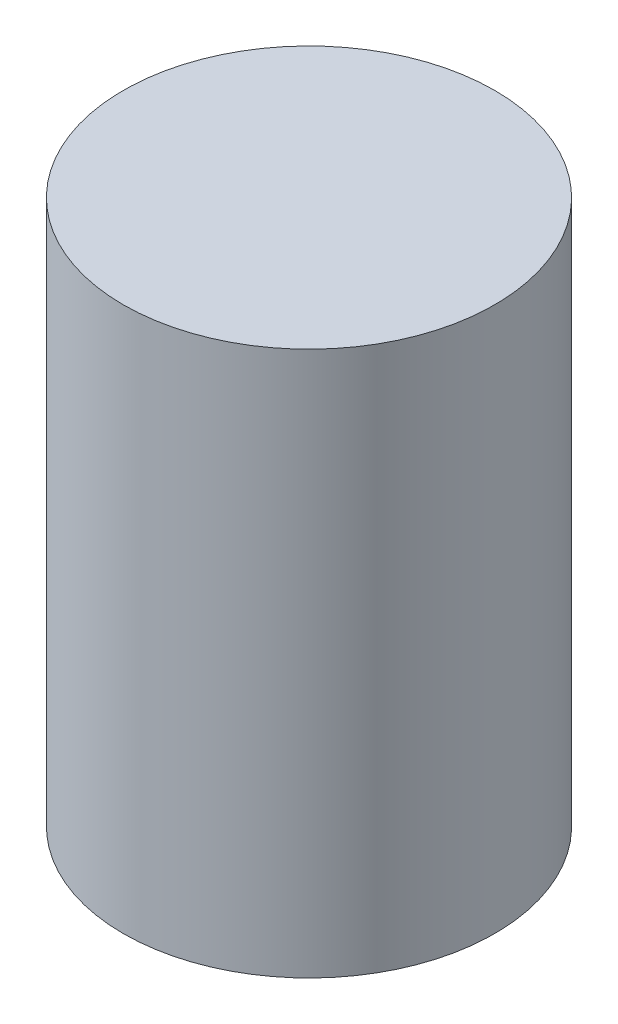
ISO-10303-21;
HEADER;
FILE_DESCRIPTION(('STEP AP214'),'2;1');
FILE_NAME('part.step','',(''),(''),'','','');
FILE_SCHEMA(('AUTOMOTIVE_DESIGN { 1 0 10303 214 1 1 1 1 }'));
ENDSEC;
DATA;
#1=APPLICATION_CONTEXT('core data for automotive mechanical design processes');
#2=APPLICATION_PROTOCOL_DEFINITION('international standard','automotive_design',2000,#1);
#3=PRODUCT_CONTEXT('',#1,'mechanical');
#4=PRODUCT('Part','Part','',(#3));
#5=PRODUCT_RELATED_PRODUCT_CATEGORY('part','',(#4));
#6=PRODUCT_DEFINITION_FORMATION('','',#4);
#7=PRODUCT_DEFINITION_CONTEXT('part definition',#1,'design');
#8=PRODUCT_DEFINITION('design','',#6,#7);
#9=PRODUCT_DEFINITION_SHAPE('','',#8);
#10=(LENGTH_UNIT() NAMED_UNIT(*) SI_UNIT(.MILLI.,.METRE.));
#11=(NAMED_UNIT(*) PLANE_ANGLE_UNIT() SI_UNIT($,.RADIAN.));
#12=(NAMED_UNIT(*) SI_UNIT($,.STERADIAN.) SOLID_ANGLE_UNIT());
#13=UNCERTAINTY_MEASURE_WITH_UNIT(LENGTH_MEASURE(1.E-05),#10,'distance_accuracy_value','');
#14=(GEOMETRIC_REPRESENTATION_CONTEXT(3) GLOBAL_UNCERTAINTY_ASSIGNED_CONTEXT((#13)) GLOBAL_UNIT_ASSIGNED_CONTEXT((#10,
#11,#12)) REPRESENTATION_CONTEXT('',''));
#15=CARTESIAN_POINT('',(0.,0.,0.));
#16=DIRECTION('',(0.,0.,1.));
#17=DIRECTION('',(1.,0.,0.));
#18=AXIS2_PLACEMENT_3D('',#15,#16,#17);
#19=CARTESIAN_POINT('',(-15.3207631100476,32.26,-23.2270195588847));
#20=DIRECTION('',(0.,-1.,0.));
#21=DIRECTION('',(0.,0.,-1.));
#22=AXIS2_PLACEMENT_3D('',#19,#20,#21);
#23=CYLINDRICAL_SURFACE('',#22,11.);
#24=CARTESIAN_POINT('',(-15.3207631100476,32.26,-23.2270195588847));
#25=DIRECTION('',(0.,1.,0.));
#26=DIRECTION('',(0.,0.,1.));
#27=AXIS2_PLACEMENT_3D('',#24,#25,#26);
#28=CIRCLE('',#27,11.);
#29=CARTESIAN_POINT('',(-15.3207631100476,32.26,-12.2270195588847));
#30=VERTEX_POINT('',#29);
#31=EDGE_CURVE('E10',#30,#30,#28,.T.);
#32=ORIENTED_EDGE('',*,*,#31,.F.);
#33=EDGE_LOOP('',(#32));
#34=FACE_BOUND('',#33,.T.);
#35=CARTESIAN_POINT('',(-15.3207631100476,0.,-23.2270195588847));
#36=DIRECTION('',(0.,1.,0.));
#37=DIRECTION('',(0.,0.,1.));
#38=AXIS2_PLACEMENT_3D('',#35,#36,#37);
#39=CIRCLE('',#38,11.);
#40=CARTESIAN_POINT('',(-15.3207631100476,0.,-12.2270195588847));
#41=VERTEX_POINT('',#40);
#42=EDGE_CURVE('E40',#41,#41,#39,.T.);
#43=ORIENTED_EDGE('',*,*,#42,.T.);
#44=EDGE_LOOP('',(#43));
#45=FACE_BOUND('',#44,.T.);
#46=ADVANCED_FACE('F37',(#34,#45),#23,.T.);
#47=CARTESIAN_POINT('',(-15.3207631100476,32.26,-23.2270195588847));
#48=DIRECTION('',(0.,1.,0.));
#49=DIRECTION('',(0.,0.,1.));
#50=AXIS2_PLACEMENT_3D('',#47,#48,#49);
#51=PLANE('',#50);
#52=ORIENTED_EDGE('',*,*,#31,.T.);
#53=EDGE_LOOP('',(#52));
#54=FACE_BOUND('',#53,.T.);
#55=ADVANCED_FACE('F52',(#54),#51,.T.);
#56=CARTESIAN_POINT('',(-15.3207631100476,0.,-23.2270195588847));
#57=DIRECTION('',(0.,1.,0.));
#58=DIRECTION('',(0.,0.,1.));
#59=AXIS2_PLACEMENT_3D('',#56,#57,#58);
#60=PLANE('',#59);
#61=ORIENTED_EDGE('',*,*,#42,.F.);
#62=EDGE_LOOP('',(#61));
#63=FACE_BOUND('',#62,.T.);
#64=ADVANCED_FACE('F50',(#63),#60,.F.);
#65=CLOSED_SHELL('',(#46,#55,#64));
#66=MANIFOLD_SOLID_BREP('B2',#65);
#67=ADVANCED_BREP_SHAPE_REPRESENTATION('',(#18,#66),#14);
#68=SHAPE_DEFINITION_REPRESENTATION(#9,#67);
ENDSEC;
END-ISO-10303-21;
